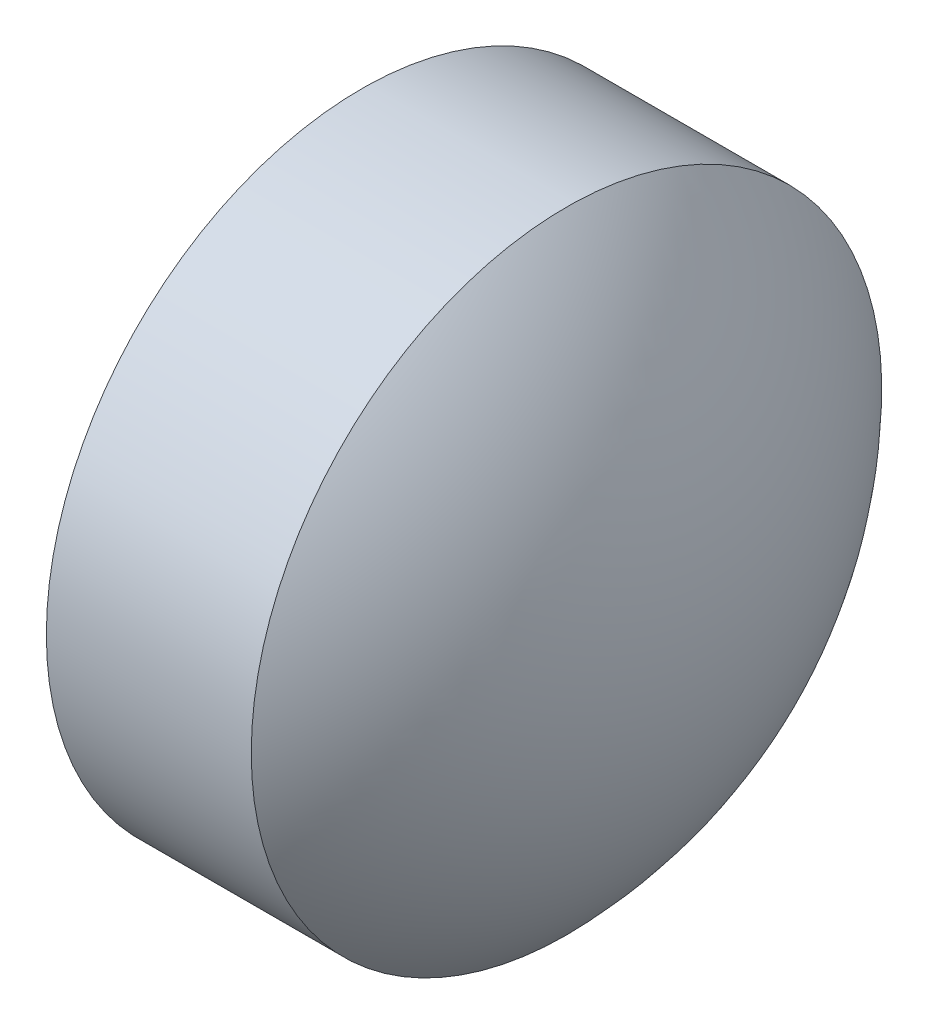
ISO-10303-21;
HEADER;
FILE_DESCRIPTION(('STEP AP214'),'2;1');
FILE_NAME('part.step','',(''),(''),'','','');
FILE_SCHEMA(('AUTOMOTIVE_DESIGN { 1 0 10303 214 1 1 1 1 }'));
ENDSEC;
DATA;
#1=APPLICATION_CONTEXT('core data for automotive mechanical design processes');
#2=APPLICATION_PROTOCOL_DEFINITION('international standard','automotive_design',2000,#1);
#3=PRODUCT_CONTEXT('',#1,'mechanical');
#4=PRODUCT('Part','Part','',(#3));
#5=PRODUCT_RELATED_PRODUCT_CATEGORY('part','',(#4));
#6=PRODUCT_DEFINITION_FORMATION('','',#4);
#7=PRODUCT_DEFINITION_CONTEXT('part definition',#1,'design');
#8=PRODUCT_DEFINITION('design','',#6,#7);
#9=PRODUCT_DEFINITION_SHAPE('','',#8);
#10=(LENGTH_UNIT() NAMED_UNIT(*) SI_UNIT(.MILLI.,.METRE.));
#11=(NAMED_UNIT(*) PLANE_ANGLE_UNIT() SI_UNIT($,.RADIAN.));
#12=(NAMED_UNIT(*) SI_UNIT($,.STERADIAN.) SOLID_ANGLE_UNIT());
#13=UNCERTAINTY_MEASURE_WITH_UNIT(LENGTH_MEASURE(1.E-05),#10,'distance_accuracy_value','');
#14=(GEOMETRIC_REPRESENTATION_CONTEXT(3) GLOBAL_UNCERTAINTY_ASSIGNED_CONTEXT((#13)) GLOBAL_UNIT_ASSIGNED_CONTEXT((#10,
#11,#12)) REPRESENTATION_CONTEXT('',''));
#15=CARTESIAN_POINT('',(0.,0.,0.));
#16=DIRECTION('',(0.,0.,1.));
#17=DIRECTION('',(1.,0.,0.));
#18=AXIS2_PLACEMENT_3D('',#15,#16,#17);
#19=CARTESIAN_POINT('',(368.597890342225,55.6768258796991,0.));
#20=DIRECTION('',(-1.,0.,0.));
#21=DIRECTION('',(0.,-1.,0.));
#22=AXIS2_PLACEMENT_3D('',#19,#20,#21);
#23=SPHERICAL_SURFACE('',#22,2.87413580246915);
#24=CARTESIAN_POINT('',(370.662026144695,55.6768258796991,0.));
#25=DIRECTION('',(-1.,0.,0.));
#26=DIRECTION('',(0.,0.,1.));
#27=AXIS2_PLACEMENT_3D('',#24,#25,#26);
#28=CIRCLE('',#27,2.);
#29=CARTESIAN_POINT('',(370.662026144695,55.6768258796991,2.));
#30=VERTEX_POINT('',#29);
#31=EDGE_CURVE('E10',#30,#30,#28,.T.);
#32=ORIENTED_EDGE('',*,*,#31,.F.);
#33=EDGE_LOOP('',(#32));
#34=FACE_BOUND('',#33,.T.);
#35=ADVANCED_FACE('F35',(#34),#23,.T.);
#36=CARTESIAN_POINT('',(368.933919450648,55.6768258796991,0.));
#37=DIRECTION('',(-1.,0.,0.));
#38=DIRECTION('',(0.,0.,1.));
#39=AXIS2_PLACEMENT_3D('',#36,#37,#38);
#40=CYLINDRICAL_SURFACE('',#39,2.);
#41=CARTESIAN_POINT('',(369.362026144695,55.6768258796991,0.));
#42=DIRECTION('',(-1.,0.,0.));
#43=DIRECTION('',(0.,0.,1.));
#44=AXIS2_PLACEMENT_3D('',#41,#42,#43);
#45=CIRCLE('',#44,2.);
#46=CARTESIAN_POINT('',(369.362026144695,55.6768258796991,2.));
#47=VERTEX_POINT('',#46);
#48=EDGE_CURVE('E41',#47,#47,#45,.T.);
#49=ORIENTED_EDGE('',*,*,#48,.F.);
#50=EDGE_LOOP('',(#49));
#51=FACE_BOUND('',#50,.T.);
#52=ORIENTED_EDGE('',*,*,#31,.T.);
#53=EDGE_LOOP('',(#52));
#54=FACE_BOUND('',#53,.T.);
#55=ADVANCED_FACE('F49',(#51,#54),#40,.T.);
#56=CARTESIAN_POINT('',(369.362026144695,55.6768258796991,0.));
#57=DIRECTION('',(1.,0.,0.));
#58=DIRECTION('',(0.,0.,-1.));
#59=AXIS2_PLACEMENT_3D('',#56,#57,#58);
#60=PLANE('',#59);
#61=ORIENTED_EDGE('',*,*,#48,.T.);
#62=EDGE_LOOP('',(#61));
#63=FACE_BOUND('',#62,.T.);
#64=ADVANCED_FACE('F47',(#63),#60,.F.);
#65=CLOSED_SHELL('',(#35,#55,#64));
#66=MANIFOLD_SOLID_BREP('B2',#65);
#67=ADVANCED_BREP_SHAPE_REPRESENTATION('',(#18,#66),#14);
#68=SHAPE_DEFINITION_REPRESENTATION(#9,#67);
ENDSEC;
END-ISO-10303-21;
